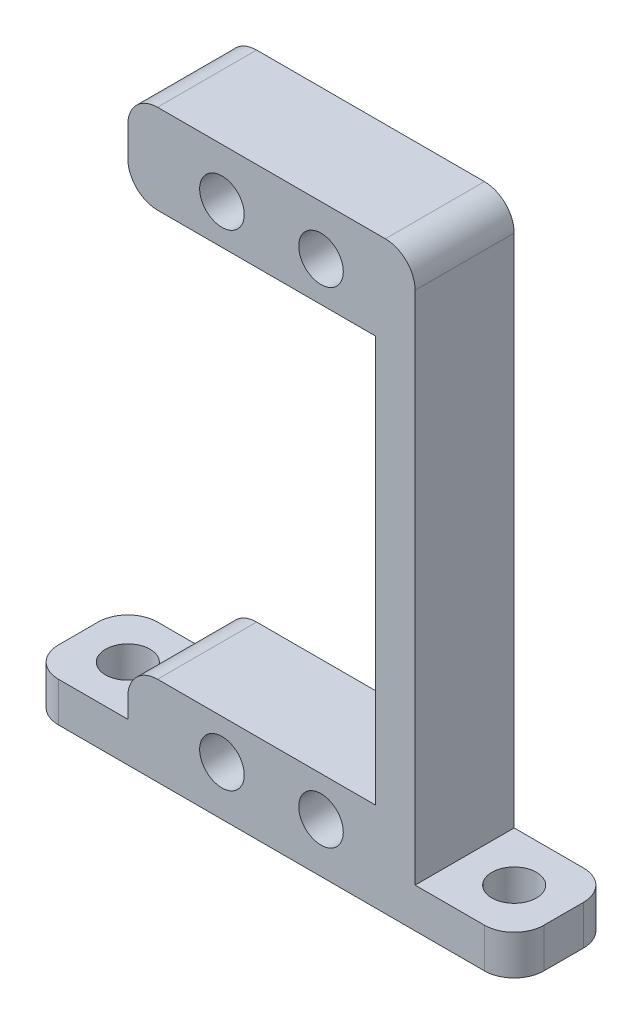
ISO-10303-21;
HEADER;
FILE_DESCRIPTION(('STEP AP214'),'2;1');
FILE_NAME('part.step','',(''),(''),'','','');
FILE_SCHEMA(('AUTOMOTIVE_DESIGN { 1 0 10303 214 1 1 1 1 }'));
ENDSEC;
DATA;
#1=APPLICATION_CONTEXT('core data for automotive mechanical design processes');
#2=APPLICATION_PROTOCOL_DEFINITION('international standard','automotive_design',2000,#1);
#3=PRODUCT_CONTEXT('',#1,'mechanical');
#4=PRODUCT('Part','Part','',(#3));
#5=PRODUCT_RELATED_PRODUCT_CATEGORY('part','',(#4));
#6=PRODUCT_DEFINITION_FORMATION('','',#4);
#7=PRODUCT_DEFINITION_CONTEXT('part definition',#1,'design');
#8=PRODUCT_DEFINITION('design','',#6,#7);
#9=PRODUCT_DEFINITION_SHAPE('','',#8);
#10=(LENGTH_UNIT() NAMED_UNIT(*) SI_UNIT(.MILLI.,.METRE.));
#11=(NAMED_UNIT(*) PLANE_ANGLE_UNIT() SI_UNIT($,.RADIAN.));
#12=(NAMED_UNIT(*) SI_UNIT($,.STERADIAN.) SOLID_ANGLE_UNIT());
#13=UNCERTAINTY_MEASURE_WITH_UNIT(LENGTH_MEASURE(1.E-05),#10,'distance_accuracy_value','');
#14=(GEOMETRIC_REPRESENTATION_CONTEXT(3) GLOBAL_UNCERTAINTY_ASSIGNED_CONTEXT((#13)) GLOBAL_UNIT_ASSIGNED_CONTEXT((#10,
#11,#12)) REPRESENTATION_CONTEXT('',''));
#15=CARTESIAN_POINT('',(0.,0.,0.));
#16=DIRECTION('',(0.,0.,1.));
#17=DIRECTION('',(1.,0.,0.));
#18=AXIS2_PLACEMENT_3D('',#15,#16,#17);
#19=CARTESIAN_POINT('',(0.,-25.5,10.));
#20=DIRECTION('',(0.,1.,0.));
#21=DIRECTION('',(0.,0.,1.));
#22=AXIS2_PLACEMENT_3D('',#19,#20,#21);
#23=PLANE('',#22);
#24=CARTESIAN_POINT('',(-19.5,-25.5,5.));
#25=DIRECTION('',(0.,1.,0.));
#26=DIRECTION('',(0.,0.,-1.));
#27=AXIS2_PLACEMENT_3D('',#24,#25,#26);
#28=CIRCLE('',#27,2.25);
#29=CARTESIAN_POINT('',(-19.5,-25.5,2.75));
#30=VERTEX_POINT('',#29);
#31=EDGE_CURVE('E501',#30,#30,#28,.T.);
#32=ORIENTED_EDGE('',*,*,#31,.F.);
#33=EDGE_LOOP('',(#32));
#34=FACE_BOUND('',#33,.T.);
#35=DIRECTION('',(1.,0.,0.));
#36=VECTOR('',#35,1.);
#37=CARTESIAN_POINT('',(0.,-25.5,0.));
#38=LINE('',#37,#36);
#39=CARTESIAN_POINT('',(-21.5,-25.5,0.));
#40=VERTEX_POINT('',#39);
#41=CARTESIAN_POINT('',(-14.5,-25.5,0.));
#42=VERTEX_POINT('',#41);
#43=EDGE_CURVE('E219',#40,#42,#38,.T.);
#44=ORIENTED_EDGE('',*,*,#43,.F.);
#45=CARTESIAN_POINT('',(-21.5,-25.5,3.));
#46=DIRECTION('',(0.,1.,0.));
#47=DIRECTION('',(0.,0.,1.));
#48=AXIS2_PLACEMENT_3D('',#45,#46,#47);
#49=CIRCLE('',#48,3.);
#50=CARTESIAN_POINT('',(-24.5,-25.5,3.));
#51=VERTEX_POINT('',#50);
#52=EDGE_CURVE('E265',#40,#51,#49,.T.);
#53=ORIENTED_EDGE('',*,*,#52,.T.);
#54=DIRECTION('',(0.,0.,-1.));
#55=VECTOR('',#54,1.);
#56=CARTESIAN_POINT('',(-24.5,-25.5,10.));
#57=LINE('',#56,#55);
#58=CARTESIAN_POINT('',(-24.5,-25.5,7.));
#59=VERTEX_POINT('',#58);
#60=EDGE_CURVE('E212',#59,#51,#57,.T.);
#61=ORIENTED_EDGE('',*,*,#60,.F.);
#62=CARTESIAN_POINT('',(-21.5,-25.5,7.));
#63=DIRECTION('',(0.,1.,0.));
#64=DIRECTION('',(0.,0.,1.));
#65=AXIS2_PLACEMENT_3D('',#62,#63,#64);
#66=CIRCLE('',#65,3.);
#67=CARTESIAN_POINT('',(-21.5,-25.5,10.));
#68=VERTEX_POINT('',#67);
#69=EDGE_CURVE('E263',#59,#68,#66,.T.);
#70=ORIENTED_EDGE('',*,*,#69,.T.);
#71=DIRECTION('',(1.,0.,0.));
#72=VECTOR('',#71,1.);
#73=CARTESIAN_POINT('',(0.,-25.5,10.));
#74=LINE('',#73,#72);
#75=CARTESIAN_POINT('',(-14.5,-25.5,10.));
#76=VERTEX_POINT('',#75);
#77=EDGE_CURVE('E336',#68,#76,#74,.T.);
#78=ORIENTED_EDGE('',*,*,#77,.T.);
#79=DIRECTION('',(0.,0.,-1.));
#80=VECTOR('',#79,1.);
#81=CARTESIAN_POINT('',(-14.5,-25.5,10.));
#82=LINE('',#81,#80);
#83=EDGE_CURVE('E337',#76,#42,#82,.T.);
#84=ORIENTED_EDGE('',*,*,#83,.T.);
#85=EDGE_LOOP('',(#44,#53,#61,#70,#78,#84));
#86=FACE_BOUND('',#85,.T.);
#87=ADVANCED_FACE('F36',(#34,#86),#23,.T.);
#88=CARTESIAN_POINT('',(-24.5,0.,10.));
#89=DIRECTION('',(-1.,0.,0.));
#90=DIRECTION('',(0.,0.,1.));
#91=AXIS2_PLACEMENT_3D('',#88,#89,#90);
#92=PLANE('',#91);
#93=ORIENTED_EDGE('',*,*,#60,.T.);
#94=DIRECTION('',(0.,1.,0.));
#95=VECTOR('',#94,1.);
#96=CARTESIAN_POINT('',(-24.5,-29.5,3.));
#97=LINE('',#96,#95);
#98=CARTESIAN_POINT('',(-24.5,-29.5,3.));
#99=VERTEX_POINT('',#98);
#100=EDGE_CURVE('E270',#51,#99,#97,.F.);
#101=ORIENTED_EDGE('',*,*,#100,.T.);
#102=DIRECTION('',(0.,0.,-1.));
#103=VECTOR('',#102,1.);
#104=CARTESIAN_POINT('',(-24.5,-29.5,10.));
#105=LINE('',#104,#103);
#106=CARTESIAN_POINT('',(-24.5,-29.5,7.));
#107=VERTEX_POINT('',#106);
#108=EDGE_CURVE('E209',#107,#99,#105,.T.);
#109=ORIENTED_EDGE('',*,*,#108,.F.);
#110=DIRECTION('',(0.,1.,0.));
#111=VECTOR('',#110,1.);
#112=CARTESIAN_POINT('',(-24.5,0.,7.));
#113=LINE('',#112,#111);
#114=EDGE_CURVE('E267',#107,#59,#113,.T.);
#115=ORIENTED_EDGE('',*,*,#114,.T.);
#116=EDGE_LOOP('',(#93,#101,#109,#115));
#117=FACE_BOUND('',#116,.T.);
#118=ADVANCED_FACE('F401',(#117),#92,.T.);
#119=CARTESIAN_POINT('',(0.,-29.5,10.));
#120=DIRECTION('',(0.,-1.,0.));
#121=DIRECTION('',(1.,0.,0.));
#122=AXIS2_PLACEMENT_3D('',#119,#120,#121);
#123=PLANE('',#122);
#124=CARTESIAN_POINT('',(19.5,-29.5,5.));
#125=DIRECTION('',(0.,-1.,0.));
#126=DIRECTION('',(1.,0.,0.));
#127=AXIS2_PLACEMENT_3D('',#124,#125,#126);
#128=CIRCLE('',#127,2.25);
#129=CARTESIAN_POINT('',(21.75,-29.5,5.));
#130=VERTEX_POINT('',#129);
#131=EDGE_CURVE('E220',#130,#130,#128,.T.);
#132=ORIENTED_EDGE('',*,*,#131,.F.);
#133=EDGE_LOOP('',(#132));
#134=FACE_BOUND('',#133,.T.);
#135=CARTESIAN_POINT('',(-19.5,-29.5,5.));
#136=DIRECTION('',(0.,-1.,0.));
#137=DIRECTION('',(1.,0.,0.));
#138=AXIS2_PLACEMENT_3D('',#135,#136,#137);
#139=CIRCLE('',#138,2.25);
#140=CARTESIAN_POINT('',(-17.25,-29.5,5.));
#141=VERTEX_POINT('',#140);
#142=EDGE_CURVE('E216',#141,#141,#139,.T.);
#143=ORIENTED_EDGE('',*,*,#142,.F.);
#144=EDGE_LOOP('',(#143));
#145=FACE_BOUND('',#144,.T.);
#146=ORIENTED_EDGE('',*,*,#108,.T.);
#147=CARTESIAN_POINT('',(-21.5,-29.5,3.));
#148=DIRECTION('',(0.,-1.,0.));
#149=DIRECTION('',(1.,0.,0.));
#150=AXIS2_PLACEMENT_3D('',#147,#148,#149);
#151=CIRCLE('',#150,3.);
#152=CARTESIAN_POINT('',(-21.5,-29.5,0.));
#153=VERTEX_POINT('',#152);
#154=EDGE_CURVE('E278',#99,#153,#151,.T.);
#155=ORIENTED_EDGE('',*,*,#154,.T.);
#156=DIRECTION('',(-1.,0.,0.));
#157=VECTOR('',#156,1.);
#158=CARTESIAN_POINT('',(0.,-29.5,0.));
#159=LINE('',#158,#157);
#160=CARTESIAN_POINT('',(21.5,-29.5,0.));
#161=VERTEX_POINT('',#160);
#162=EDGE_CURVE('E295',#161,#153,#159,.T.);
#163=ORIENTED_EDGE('',*,*,#162,.F.);
#164=CARTESIAN_POINT('',(21.5,-29.5,3.));
#165=DIRECTION('',(0.,-1.,0.));
#166=DIRECTION('',(1.,0.,0.));
#167=AXIS2_PLACEMENT_3D('',#164,#165,#166);
#168=CIRCLE('',#167,3.);
#169=CARTESIAN_POINT('',(24.5,-29.5,3.));
#170=VERTEX_POINT('',#169);
#171=EDGE_CURVE('E274',#161,#170,#168,.T.);
#172=ORIENTED_EDGE('',*,*,#171,.T.);
#173=DIRECTION('',(0.,0.,-1.));
#174=VECTOR('',#173,1.);
#175=CARTESIAN_POINT('',(24.5,-29.5,10.));
#176=LINE('',#175,#174);
#177=CARTESIAN_POINT('',(24.5,-29.5,7.));
#178=VERTEX_POINT('',#177);
#179=EDGE_CURVE('E201',#178,#170,#176,.T.);
#180=ORIENTED_EDGE('',*,*,#179,.F.);
#181=CARTESIAN_POINT('',(21.5,-29.5,7.));
#182=DIRECTION('',(0.,-1.,0.));
#183=DIRECTION('',(1.,0.,0.));
#184=AXIS2_PLACEMENT_3D('',#181,#182,#183);
#185=CIRCLE('',#184,3.);
#186=CARTESIAN_POINT('',(21.5,-29.5,10.));
#187=VERTEX_POINT('',#186);
#188=EDGE_CURVE('E272',#178,#187,#185,.T.);
#189=ORIENTED_EDGE('',*,*,#188,.T.);
#190=DIRECTION('',(-1.,0.,0.));
#191=VECTOR('',#190,1.);
#192=CARTESIAN_POINT('',(0.,-29.5,10.));
#193=LINE('',#192,#191);
#194=CARTESIAN_POINT('',(-21.5,-29.5,10.));
#195=VERTEX_POINT('',#194);
#196=EDGE_CURVE('E192',#187,#195,#193,.T.);
#197=ORIENTED_EDGE('',*,*,#196,.T.);
#198=CARTESIAN_POINT('',(-21.5,-29.5,7.));
#199=DIRECTION('',(0.,-1.,0.));
#200=DIRECTION('',(1.,0.,0.));
#201=AXIS2_PLACEMENT_3D('',#198,#199,#200);
#202=CIRCLE('',#201,3.);
#203=EDGE_CURVE('E276',#195,#107,#202,.T.);
#204=ORIENTED_EDGE('',*,*,#203,.T.);
#205=EDGE_LOOP('',(#146,#155,#163,#172,#180,#189,#197,#204));
#206=FACE_BOUND('',#205,.T.);
#207=ADVANCED_FACE('F299',(#134,#145,#206),#123,.T.);
#208=CARTESIAN_POINT('',(24.5,0.,10.));
#209=DIRECTION('',(-1.,0.,0.));
#210=DIRECTION('',(0.,0.,1.));
#211=AXIS2_PLACEMENT_3D('',#208,#209,#210);
#212=PLANE('',#211);
#213=ORIENTED_EDGE('',*,*,#179,.T.);
#214=DIRECTION('',(0.,1.,0.));
#215=VECTOR('',#214,1.);
#216=CARTESIAN_POINT('',(24.5,0.,3.));
#217=LINE('',#216,#215);
#218=CARTESIAN_POINT('',(24.5,-25.5,3.));
#219=VERTEX_POINT('',#218);
#220=EDGE_CURVE('E282',#170,#219,#217,.T.);
#221=ORIENTED_EDGE('',*,*,#220,.T.);
#222=DIRECTION('',(0.,0.,-1.));
#223=VECTOR('',#222,1.);
#224=CARTESIAN_POINT('',(24.5,-25.5,10.));
#225=LINE('',#224,#223);
#226=CARTESIAN_POINT('',(24.5,-25.5,7.));
#227=VERTEX_POINT('',#226);
#228=EDGE_CURVE('E198',#227,#219,#225,.T.);
#229=ORIENTED_EDGE('',*,*,#228,.F.);
#230=DIRECTION('',(0.,1.,0.));
#231=VECTOR('',#230,1.);
#232=CARTESIAN_POINT('',(24.5,-29.5,7.));
#233=LINE('',#232,#231);
#234=EDGE_CURVE('E280',#227,#178,#233,.F.);
#235=ORIENTED_EDGE('',*,*,#234,.T.);
#236=EDGE_LOOP('',(#213,#221,#229,#235));
#237=FACE_BOUND('',#236,.T.);
#238=ADVANCED_FACE('F284',(#237),#212,.F.);
#239=CARTESIAN_POINT('',(0.,-25.5,10.));
#240=DIRECTION('',(0.,-1.,0.));
#241=DIRECTION('',(0.,0.,-1.));
#242=AXIS2_PLACEMENT_3D('',#239,#240,#241);
#243=PLANE('',#242);
#244=CARTESIAN_POINT('',(19.5,-25.5,5.));
#245=DIRECTION('',(0.,1.,0.));
#246=DIRECTION('',(0.,0.,1.));
#247=AXIS2_PLACEMENT_3D('',#244,#245,#246);
#248=CIRCLE('',#247,2.25);
#249=CARTESIAN_POINT('',(19.5,-25.5,7.25));
#250=VERTEX_POINT('',#249);
#251=EDGE_CURVE('E502',#250,#250,#248,.T.);
#252=ORIENTED_EDGE('',*,*,#251,.F.);
#253=EDGE_LOOP('',(#252));
#254=FACE_BOUND('',#253,.T.);
#255=ORIENTED_EDGE('',*,*,#228,.T.);
#256=CARTESIAN_POINT('',(21.5,-25.5,3.));
#257=DIRECTION('',(0.,-1.,0.));
#258=DIRECTION('',(0.,0.,-1.));
#259=AXIS2_PLACEMENT_3D('',#256,#257,#258);
#260=CIRCLE('',#259,3.);
#261=CARTESIAN_POINT('',(21.5,-25.5,0.));
#262=VERTEX_POINT('',#261);
#263=EDGE_CURVE('E11',#219,#262,#260,.F.);
#264=ORIENTED_EDGE('',*,*,#263,.T.);
#265=DIRECTION('',(-1.,0.,0.));
#266=VECTOR('',#265,1.);
#267=CARTESIAN_POINT('',(0.,-25.5,0.));
#268=LINE('',#267,#266);
#269=CARTESIAN_POINT('',(14.5,-25.5,0.));
#270=VERTEX_POINT('',#269);
#271=EDGE_CURVE('E196',#262,#270,#268,.T.);
#272=ORIENTED_EDGE('',*,*,#271,.T.);
#273=DIRECTION('',(0.,0.,-1.));
#274=VECTOR('',#273,1.);
#275=CARTESIAN_POINT('',(14.5,-25.5,10.));
#276=LINE('',#275,#274);
#277=CARTESIAN_POINT('',(14.5,-25.5,10.));
#278=VERTEX_POINT('',#277);
#279=EDGE_CURVE('E177',#278,#270,#276,.T.);
#280=ORIENTED_EDGE('',*,*,#279,.F.);
#281=DIRECTION('',(-1.,0.,0.));
#282=VECTOR('',#281,1.);
#283=CARTESIAN_POINT('',(0.,-25.5,10.));
#284=LINE('',#283,#282);
#285=CARTESIAN_POINT('',(21.5,-25.5,10.));
#286=VERTEX_POINT('',#285);
#287=EDGE_CURVE('E183',#286,#278,#284,.T.);
#288=ORIENTED_EDGE('',*,*,#287,.F.);
#289=CARTESIAN_POINT('',(21.5,-25.5,7.));
#290=DIRECTION('',(0.,-1.,0.));
#291=DIRECTION('',(0.,0.,-1.));
#292=AXIS2_PLACEMENT_3D('',#289,#290,#291);
#293=CIRCLE('',#292,3.);
#294=EDGE_CURVE('E44',#286,#227,#293,.F.);
#295=ORIENTED_EDGE('',*,*,#294,.T.);
#296=EDGE_LOOP('',(#255,#264,#272,#280,#288,#295));
#297=FACE_BOUND('',#296,.T.);
#298=ADVANCED_FACE('F194',(#254,#297),#243,.F.);
#299=CARTESIAN_POINT('',(14.5,0.,10.));
#300=DIRECTION('',(1.,0.,0.));
#301=DIRECTION('',(0.,1.,0.));
#302=AXIS2_PLACEMENT_3D('',#299,#300,#301);
#303=PLANE('',#302);
#304=DIRECTION('',(0.,-1.,0.));
#305=VECTOR('',#304,1.);
#306=CARTESIAN_POINT('',(14.5,0.,0.));
#307=LINE('',#306,#305);
#308=CARTESIAN_POINT('',(14.5,26.5,0.));
#309=VERTEX_POINT('',#308);
#310=EDGE_CURVE('E294',#309,#270,#307,.T.);
#311=ORIENTED_EDGE('',*,*,#310,.F.);
#312=DIRECTION('',(0.,0.,-1.));
#313=VECTOR('',#312,1.);
#314=CARTESIAN_POINT('',(14.5,26.5,10.));
#315=LINE('',#314,#313);
#316=CARTESIAN_POINT('',(14.5,26.5,10.));
#317=VERTEX_POINT('',#316);
#318=EDGE_CURVE('E179',#309,#317,#315,.F.);
#319=ORIENTED_EDGE('',*,*,#318,.T.);
#320=DIRECTION('',(0.,-1.,0.));
#321=VECTOR('',#320,1.);
#322=CARTESIAN_POINT('',(14.5,0.,10.));
#323=LINE('',#322,#321);
#324=EDGE_CURVE('E172',#317,#278,#323,.T.);
#325=ORIENTED_EDGE('',*,*,#324,.T.);
#326=ORIENTED_EDGE('',*,*,#279,.T.);
#327=EDGE_LOOP('',(#311,#319,#325,#326));
#328=FACE_BOUND('',#327,.T.);
#329=ADVANCED_FACE('F175',(#328),#303,.T.);
#330=CARTESIAN_POINT('',(0.,29.5,10.));
#331=DIRECTION('',(0.,1.,0.));
#332=DIRECTION('',(0.,0.,1.));
#333=AXIS2_PLACEMENT_3D('',#330,#331,#332);
#334=PLANE('',#333);
#335=DIRECTION('',(1.,0.,0.));
#336=VECTOR('',#335,1.);
#337=CARTESIAN_POINT('',(0.,29.5,10.));
#338=LINE('',#337,#336);
#339=CARTESIAN_POINT('',(-11.5,29.5,10.));
#340=VERTEX_POINT('',#339);
#341=CARTESIAN_POINT('',(11.5,29.5,10.));
#342=VERTEX_POINT('',#341);
#343=EDGE_CURVE('E182',#340,#342,#338,.T.);
#344=ORIENTED_EDGE('',*,*,#343,.T.);
#345=DIRECTION('',(0.,0.,-1.));
#346=VECTOR('',#345,1.);
#347=CARTESIAN_POINT('',(11.5,29.5,10.));
#348=LINE('',#347,#346);
#349=CARTESIAN_POINT('',(11.5,29.5,0.));
#350=VERTEX_POINT('',#349);
#351=EDGE_CURVE('E251',#342,#350,#348,.T.);
#352=ORIENTED_EDGE('',*,*,#351,.T.);
#353=DIRECTION('',(1.,0.,0.));
#354=VECTOR('',#353,1.);
#355=CARTESIAN_POINT('',(0.,29.5,0.));
#356=LINE('',#355,#354);
#357=CARTESIAN_POINT('',(-11.5,29.5,0.));
#358=VERTEX_POINT('',#357);
#359=EDGE_CURVE('E308',#358,#350,#356,.T.);
#360=ORIENTED_EDGE('',*,*,#359,.F.);
#361=DIRECTION('',(0.,0.,-1.));
#362=VECTOR('',#361,1.);
#363=CARTESIAN_POINT('',(-11.5,29.5,10.));
#364=LINE('',#363,#362);
#365=EDGE_CURVE('E249',#358,#340,#364,.F.);
#366=ORIENTED_EDGE('',*,*,#365,.T.);
#367=EDGE_LOOP('',(#344,#352,#360,#366));
#368=FACE_BOUND('',#367,.T.);
#369=ADVANCED_FACE('F471',(#368),#334,.T.);
#370=CARTESIAN_POINT('',(-14.5,0.,10.));
#371=DIRECTION('',(-1.,0.,0.));
#372=DIRECTION('',(0.,-1.,0.));
#373=AXIS2_PLACEMENT_3D('',#370,#371,#372);
#374=PLANE('',#373);
#375=DIRECTION('',(0.,1.,0.));
#376=VECTOR('',#375,1.);
#377=CARTESIAN_POINT('',(-14.5,0.,0.));
#378=LINE('',#377,#376);
#379=CARTESIAN_POINT('',(-14.5,23.5,0.));
#380=VERTEX_POINT('',#379);
#381=CARTESIAN_POINT('',(-14.5,26.5,0.));
#382=VERTEX_POINT('',#381);
#383=EDGE_CURVE('E311',#380,#382,#378,.T.);
#384=ORIENTED_EDGE('',*,*,#383,.F.);
#385=DIRECTION('',(0.,0.,-1.));
#386=VECTOR('',#385,1.);
#387=CARTESIAN_POINT('',(-14.5,23.5,10.));
#388=LINE('',#387,#386);
#389=CARTESIAN_POINT('',(-14.5,23.5,10.));
#390=VERTEX_POINT('',#389);
#391=EDGE_CURVE('E261',#380,#390,#388,.F.);
#392=ORIENTED_EDGE('',*,*,#391,.T.);
#393=DIRECTION('',(0.,1.,0.));
#394=VECTOR('',#393,1.);
#395=CARTESIAN_POINT('',(-14.5,0.,10.));
#396=LINE('',#395,#394);
#397=CARTESIAN_POINT('',(-14.5,26.5,10.));
#398=VERTEX_POINT('',#397);
#399=EDGE_CURVE('E451',#390,#398,#396,.T.);
#400=ORIENTED_EDGE('',*,*,#399,.T.);
#401=DIRECTION('',(0.,0.,-1.));
#402=VECTOR('',#401,1.);
#403=CARTESIAN_POINT('',(-14.5,26.5,10.));
#404=LINE('',#403,#402);
#405=EDGE_CURVE('E258',#398,#382,#404,.T.);
#406=ORIENTED_EDGE('',*,*,#405,.T.);
#407=EDGE_LOOP('',(#384,#392,#400,#406));
#408=FACE_BOUND('',#407,.T.);
#409=ADVANCED_FACE('F465',(#408),#374,.T.);
#410=CARTESIAN_POINT('',(0.,20.5,10.));
#411=DIRECTION('',(0.,-1.,0.));
#412=DIRECTION('',(0.,0.,-1.));
#413=AXIS2_PLACEMENT_3D('',#410,#411,#412);
#414=PLANE('',#413);
#415=DIRECTION('',(-1.,0.,0.));
#416=VECTOR('',#415,1.);
#417=CARTESIAN_POINT('',(0.,20.5,10.));
#418=LINE('',#417,#416);
#419=CARTESIAN_POINT('',(10.5,20.5,10.));
#420=VERTEX_POINT('',#419);
#421=CARTESIAN_POINT('',(-11.5,20.5,10.));
#422=VERTEX_POINT('',#421);
#423=EDGE_CURVE('E454',#420,#422,#418,.T.);
#424=ORIENTED_EDGE('',*,*,#423,.T.);
#425=DIRECTION('',(0.,0.,-1.));
#426=VECTOR('',#425,1.);
#427=CARTESIAN_POINT('',(-11.5,20.5,10.));
#428=LINE('',#427,#426);
#429=CARTESIAN_POINT('',(-11.5,20.5,0.));
#430=VERTEX_POINT('',#429);
#431=EDGE_CURVE('E255',#422,#430,#428,.T.);
#432=ORIENTED_EDGE('',*,*,#431,.T.);
#433=DIRECTION('',(-1.,0.,0.));
#434=VECTOR('',#433,1.);
#435=CARTESIAN_POINT('',(0.,20.5,0.));
#436=LINE('',#435,#434);
#437=CARTESIAN_POINT('',(10.5,20.5,0.));
#438=VERTEX_POINT('',#437);
#439=EDGE_CURVE('E314',#438,#430,#436,.T.);
#440=ORIENTED_EDGE('',*,*,#439,.F.);
#441=DIRECTION('',(0.,0.,-1.));
#442=VECTOR('',#441,1.);
#443=CARTESIAN_POINT('',(10.5,20.5,10.));
#444=LINE('',#443,#442);
#445=EDGE_CURVE('E199',#420,#438,#444,.T.);
#446=ORIENTED_EDGE('',*,*,#445,.F.);
#447=EDGE_LOOP('',(#424,#432,#440,#446));
#448=FACE_BOUND('',#447,.T.);
#449=ADVANCED_FACE('F461',(#448),#414,.T.);
#450=CARTESIAN_POINT('',(10.5,0.,10.));
#451=DIRECTION('',(-1.,0.,0.));
#452=DIRECTION('',(0.,0.,1.));
#453=AXIS2_PLACEMENT_3D('',#450,#451,#452);
#454=PLANE('',#453);
#455=DIRECTION('',(0.,1.,0.));
#456=VECTOR('',#455,1.);
#457=CARTESIAN_POINT('',(10.5,0.,0.));
#458=LINE('',#457,#456);
#459=CARTESIAN_POINT('',(10.5,-20.5,0.));
#460=VERTEX_POINT('',#459);
#461=EDGE_CURVE('E317',#460,#438,#458,.T.);
#462=ORIENTED_EDGE('',*,*,#461,.F.);
#463=DIRECTION('',(0.,0.,-1.));
#464=VECTOR('',#463,1.);
#465=CARTESIAN_POINT('',(10.5,-20.5,10.));
#466=LINE('',#465,#464);
#467=CARTESIAN_POINT('',(10.5,-20.5,10.));
#468=VERTEX_POINT('',#467);
#469=EDGE_CURVE('E203',#468,#460,#466,.T.);
#470=ORIENTED_EDGE('',*,*,#469,.F.);
#471=DIRECTION('',(0.,1.,0.));
#472=VECTOR('',#471,1.);
#473=CARTESIAN_POINT('',(10.5,0.,10.));
#474=LINE('',#473,#472);
#475=EDGE_CURVE('E370',#468,#420,#474,.T.);
#476=ORIENTED_EDGE('',*,*,#475,.T.);
#477=ORIENTED_EDGE('',*,*,#445,.T.);
#478=EDGE_LOOP('',(#462,#470,#476,#477));
#479=FACE_BOUND('',#478,.T.);
#480=ADVANCED_FACE('F351',(#479),#454,.T.);
#481=CARTESIAN_POINT('',(0.,-20.5,10.));
#482=DIRECTION('',(0.,1.,0.));
#483=DIRECTION('',(0.,0.,1.));
#484=AXIS2_PLACEMENT_3D('',#481,#482,#483);
#485=PLANE('',#484);
#486=DIRECTION('',(1.,0.,0.));
#487=VECTOR('',#486,1.);
#488=CARTESIAN_POINT('',(0.,-20.5,0.));
#489=LINE('',#488,#487);
#490=CARTESIAN_POINT('',(-11.5,-20.5,0.));
#491=VERTEX_POINT('',#490);
#492=EDGE_CURVE('E320',#491,#460,#489,.T.);
#493=ORIENTED_EDGE('',*,*,#492,.F.);
#494=DIRECTION('',(0.,0.,-1.));
#495=VECTOR('',#494,1.);
#496=CARTESIAN_POINT('',(-11.5,-20.5,10.));
#497=LINE('',#496,#495);
#498=CARTESIAN_POINT('',(-11.5,-20.5,10.));
#499=VERTEX_POINT('',#498);
#500=EDGE_CURVE('E236',#491,#499,#497,.F.);
#501=ORIENTED_EDGE('',*,*,#500,.T.);
#502=DIRECTION('',(1.,0.,0.));
#503=VECTOR('',#502,1.);
#504=CARTESIAN_POINT('',(0.,-20.5,10.));
#505=LINE('',#504,#503);
#506=EDGE_CURVE('E347',#499,#468,#505,.T.);
#507=ORIENTED_EDGE('',*,*,#506,.T.);
#508=ORIENTED_EDGE('',*,*,#469,.T.);
#509=EDGE_LOOP('',(#493,#501,#507,#508));
#510=FACE_BOUND('',#509,.T.);
#511=ADVANCED_FACE('F345',(#510),#485,.T.);
#512=CARTESIAN_POINT('',(4.99999999999999,-24.5,10.));
#513=DIRECTION('',(0.,0.,-1.));
#514=DIRECTION('',(-1.,0.,0.));
#515=AXIS2_PLACEMENT_3D('',#512,#513,#514);
#516=CYLINDRICAL_SURFACE('',#515,2.25);
#517=CARTESIAN_POINT('',(4.99999999999999,-24.5,10.));
#518=DIRECTION('',(0.,0.,1.));
#519=DIRECTION('',(1.,0.,0.));
#520=AXIS2_PLACEMENT_3D('',#517,#518,#519);
#521=CIRCLE('',#520,2.25);
#522=CARTESIAN_POINT('',(7.25,-24.5,10.));
#523=VERTEX_POINT('',#522);
#524=EDGE_CURVE('E376',#523,#523,#521,.T.);
#525=ORIENTED_EDGE('',*,*,#524,.T.);
#526=EDGE_LOOP('',(#525));
#527=FACE_BOUND('',#526,.T.);
#528=CARTESIAN_POINT('',(4.99999999999999,-24.5,0.));
#529=DIRECTION('',(0.,0.,1.));
#530=DIRECTION('',(1.,0.,0.));
#531=AXIS2_PLACEMENT_3D('',#528,#529,#530);
#532=CIRCLE('',#531,2.25);
#533=CARTESIAN_POINT('',(7.25,-24.5,0.));
#534=VERTEX_POINT('',#533);
#535=EDGE_CURVE('E330',#534,#534,#532,.T.);
#536=ORIENTED_EDGE('',*,*,#535,.F.);
#537=EDGE_LOOP('',(#536));
#538=FACE_BOUND('',#537,.T.);
#539=ADVANCED_FACE('F603',(#527,#538),#516,.F.);
#540=CARTESIAN_POINT('',(-5.00000000000001,24.5,10.));
#541=DIRECTION('',(0.,0.,-1.));
#542=DIRECTION('',(-1.,0.,0.));
#543=AXIS2_PLACEMENT_3D('',#540,#541,#542);
#544=CYLINDRICAL_SURFACE('',#543,2.25);
#545=CARTESIAN_POINT('',(-5.00000000000001,24.5,10.));
#546=DIRECTION('',(0.,0.,1.));
#547=DIRECTION('',(1.,0.,0.));
#548=AXIS2_PLACEMENT_3D('',#545,#546,#547);
#549=CIRCLE('',#548,2.25);
#550=CARTESIAN_POINT('',(-2.75,24.5,10.));
#551=VERTEX_POINT('',#550);
#552=EDGE_CURVE('E368',#551,#551,#549,.T.);
#553=ORIENTED_EDGE('',*,*,#552,.T.);
#554=EDGE_LOOP('',(#553));
#555=FACE_BOUND('',#554,.T.);
#556=CARTESIAN_POINT('',(-5.00000000000001,24.5,0.));
#557=DIRECTION('',(0.,0.,1.));
#558=DIRECTION('',(1.,0.,0.));
#559=AXIS2_PLACEMENT_3D('',#556,#557,#558);
#560=CIRCLE('',#559,2.25);
#561=CARTESIAN_POINT('',(-2.75,24.5,0.));
#562=VERTEX_POINT('',#561);
#563=EDGE_CURVE('E327',#562,#562,#560,.T.);
#564=ORIENTED_EDGE('',*,*,#563,.F.);
#565=EDGE_LOOP('',(#564));
#566=FACE_BOUND('',#565,.T.);
#567=ADVANCED_FACE('F596',(#555,#566),#544,.F.);
#568=CARTESIAN_POINT('',(4.99999999999999,24.5,10.));
#569=DIRECTION('',(0.,0.,-1.));
#570=DIRECTION('',(-1.,0.,0.));
#571=AXIS2_PLACEMENT_3D('',#568,#569,#570);
#572=CYLINDRICAL_SURFACE('',#571,2.25);
#573=CARTESIAN_POINT('',(4.99999999999999,24.5,10.));
#574=DIRECTION('',(0.,0.,1.));
#575=DIRECTION('',(1.,0.,0.));
#576=AXIS2_PLACEMENT_3D('',#573,#574,#575);
#577=CIRCLE('',#576,2.25);
#578=CARTESIAN_POINT('',(7.25,24.5,10.));
#579=VERTEX_POINT('',#578);
#580=EDGE_CURVE('E365',#579,#579,#577,.F.);
#581=ORIENTED_EDGE('',*,*,#580,.F.);
#582=EDGE_LOOP('',(#581));
#583=FACE_BOUND('',#582,.T.);
#584=CARTESIAN_POINT('',(4.99999999999999,24.5,0.));
#585=DIRECTION('',(0.,0.,1.));
#586=DIRECTION('',(1.,0.,0.));
#587=AXIS2_PLACEMENT_3D('',#584,#585,#586);
#588=CIRCLE('',#587,2.25);
#589=CARTESIAN_POINT('',(7.25,24.5,0.));
#590=VERTEX_POINT('',#589);
#591=EDGE_CURVE('E324',#590,#590,#588,.F.);
#592=ORIENTED_EDGE('',*,*,#591,.T.);
#593=EDGE_LOOP('',(#592));
#594=FACE_BOUND('',#593,.T.);
#595=ADVANCED_FACE('F587',(#583,#594),#572,.F.);
#596=CARTESIAN_POINT('',(-14.5,0.,10.));
#597=DIRECTION('',(-1.,0.,0.));
#598=DIRECTION('',(0.,0.,1.));
#599=AXIS2_PLACEMENT_3D('',#596,#597,#598);
#600=PLANE('',#599);
#601=DIRECTION('',(0.,1.,0.));
#602=VECTOR('',#601,1.);
#603=CARTESIAN_POINT('',(-14.5,0.,10.));
#604=LINE('',#603,#602);
#605=CARTESIAN_POINT('',(-14.5,-23.5,10.));
#606=VERTEX_POINT('',#605);
#607=EDGE_CURVE('E363',#76,#606,#604,.T.);
#608=ORIENTED_EDGE('',*,*,#607,.T.);
#609=DIRECTION('',(0.,0.,-1.));
#610=VECTOR('',#609,1.);
#611=CARTESIAN_POINT('',(-14.5,-23.5,10.));
#612=LINE('',#611,#610);
#613=CARTESIAN_POINT('',(-14.5,-23.5,0.));
#614=VERTEX_POINT('',#613);
#615=EDGE_CURVE('E215',#606,#614,#612,.T.);
#616=ORIENTED_EDGE('',*,*,#615,.T.);
#617=DIRECTION('',(0.,1.,0.));
#618=VECTOR('',#617,1.);
#619=CARTESIAN_POINT('',(-14.5,0.,0.));
#620=LINE('',#619,#618);
#621=EDGE_CURVE('E322',#42,#614,#620,.T.);
#622=ORIENTED_EDGE('',*,*,#621,.F.);
#623=ORIENTED_EDGE('',*,*,#83,.F.);
#624=EDGE_LOOP('',(#608,#616,#622,#623));
#625=FACE_BOUND('',#624,.T.);
#626=ADVANCED_FACE('F360',(#625),#600,.T.);
#627=CARTESIAN_POINT('',(-5.00000000000001,-24.5,10.));
#628=DIRECTION('',(0.,0.,-1.));
#629=DIRECTION('',(-1.,0.,0.));
#630=AXIS2_PLACEMENT_3D('',#627,#628,#629);
#631=CYLINDRICAL_SURFACE('',#630,2.25);
#632=CARTESIAN_POINT('',(-5.00000000000001,-24.5,10.));
#633=DIRECTION('',(0.,0.,1.));
#634=DIRECTION('',(1.,0.,0.));
#635=AXIS2_PLACEMENT_3D('',#632,#633,#634);
#636=CIRCLE('',#635,2.25);
#637=CARTESIAN_POINT('',(-2.75,-24.5,10.));
#638=VERTEX_POINT('',#637);
#639=EDGE_CURVE('E339',#638,#638,#636,.F.);
#640=ORIENTED_EDGE('',*,*,#639,.F.);
#641=EDGE_LOOP('',(#640));
#642=FACE_BOUND('',#641,.T.);
#643=CARTESIAN_POINT('',(-5.00000000000001,-24.5,0.));
#644=DIRECTION('',(0.,0.,1.));
#645=DIRECTION('',(1.,0.,0.));
#646=AXIS2_PLACEMENT_3D('',#643,#644,#645);
#647=CIRCLE('',#646,2.25);
#648=CARTESIAN_POINT('',(-2.75,-24.5,0.));
#649=VERTEX_POINT('',#648);
#650=EDGE_CURVE('E333',#649,#649,#647,.F.);
#651=ORIENTED_EDGE('',*,*,#650,.T.);
#652=EDGE_LOOP('',(#651));
#653=FACE_BOUND('',#652,.T.);
#654=ADVANCED_FACE('F382',(#642,#653),#631,.F.);
#655=CARTESIAN_POINT('',(0.,0.,10.));
#656=DIRECTION('',(0.,0.,1.));
#657=DIRECTION('',(1.,0.,0.));
#658=AXIS2_PLACEMENT_3D('',#655,#656,#657);
#659=PLANE('',#658);
#660=ORIENTED_EDGE('',*,*,#506,.F.);
#661=CARTESIAN_POINT('',(-11.5,-23.5,10.));
#662=DIRECTION('',(0.,0.,1.));
#663=DIRECTION('',(1.,0.,0.));
#664=AXIS2_PLACEMENT_3D('',#661,#662,#663);
#665=CIRCLE('',#664,3.);
#666=EDGE_CURVE('E247',#499,#606,#665,.T.);
#667=ORIENTED_EDGE('',*,*,#666,.T.);
#668=ORIENTED_EDGE('',*,*,#607,.F.);
#669=ORIENTED_EDGE('',*,*,#77,.F.);
#670=DIRECTION('',(0.,1.,0.));
#671=VECTOR('',#670,1.);
#672=CARTESIAN_POINT('',(-21.5,0.,10.));
#673=LINE('',#672,#671);
#674=EDGE_CURVE('E239',#68,#195,#673,.F.);
#675=ORIENTED_EDGE('',*,*,#674,.T.);
#676=ORIENTED_EDGE('',*,*,#196,.F.);
#677=DIRECTION('',(0.,1.,0.));
#678=VECTOR('',#677,1.);
#679=CARTESIAN_POINT('',(21.5,-25.5,10.));
#680=LINE('',#679,#678);
#681=EDGE_CURVE('E191',#187,#286,#680,.T.);
#682=ORIENTED_EDGE('',*,*,#681,.T.);
#683=ORIENTED_EDGE('',*,*,#287,.T.);
#684=ORIENTED_EDGE('',*,*,#324,.F.);
#685=CARTESIAN_POINT('',(11.5,26.5,10.));
#686=DIRECTION('',(0.,0.,1.));
#687=DIRECTION('',(1.,0.,0.));
#688=AXIS2_PLACEMENT_3D('',#685,#686,#687);
#689=CIRCLE('',#688,3.);
#690=EDGE_CURVE('E245',#317,#342,#689,.T.);
#691=ORIENTED_EDGE('',*,*,#690,.T.);
#692=ORIENTED_EDGE('',*,*,#343,.F.);
#693=CARTESIAN_POINT('',(-11.5,26.5,10.));
#694=DIRECTION('',(0.,0.,1.));
#695=DIRECTION('',(1.,0.,0.));
#696=AXIS2_PLACEMENT_3D('',#693,#694,#695);
#697=CIRCLE('',#696,3.);
#698=EDGE_CURVE('E241',#340,#398,#697,.T.);
#699=ORIENTED_EDGE('',*,*,#698,.T.);
#700=ORIENTED_EDGE('',*,*,#399,.F.);
#701=CARTESIAN_POINT('',(-11.5,23.5,10.));
#702=DIRECTION('',(0.,0.,1.));
#703=DIRECTION('',(1.,0.,0.));
#704=AXIS2_PLACEMENT_3D('',#701,#702,#703);
#705=CIRCLE('',#704,3.);
#706=EDGE_CURVE('E243',#390,#422,#705,.T.);
#707=ORIENTED_EDGE('',*,*,#706,.T.);
#708=ORIENTED_EDGE('',*,*,#423,.F.);
#709=ORIENTED_EDGE('',*,*,#475,.F.);
#710=EDGE_LOOP('',(#660,#667,#668,#669,#675,#676,#682,#683,#684,#691,#692,#699,#700,#707,#708,#709));
#711=FACE_BOUND('',#710,.T.);
#712=ORIENTED_EDGE('',*,*,#580,.T.);
#713=EDGE_LOOP('',(#712));
#714=FACE_BOUND('',#713,.T.);
#715=ORIENTED_EDGE('',*,*,#552,.F.);
#716=EDGE_LOOP('',(#715));
#717=FACE_BOUND('',#716,.T.);
#718=ORIENTED_EDGE('',*,*,#524,.F.);
#719=EDGE_LOOP('',(#718));
#720=FACE_BOUND('',#719,.T.);
#721=ORIENTED_EDGE('',*,*,#639,.T.);
#722=EDGE_LOOP('',(#721));
#723=FACE_BOUND('',#722,.T.);
#724=ADVANCED_FACE('F187',(#711,#714,#717,#720,#723),#659,.T.);
#725=CARTESIAN_POINT('',(0.,0.,0.));
#726=DIRECTION('',(0.,0.,1.));
#727=DIRECTION('',(1.,0.,0.));
#728=AXIS2_PLACEMENT_3D('',#725,#726,#727);
#729=PLANE('',#728);
#730=ORIENTED_EDGE('',*,*,#621,.T.);
#731=CARTESIAN_POINT('',(-11.5,-23.5,0.));
#732=DIRECTION('',(0.,0.,1.));
#733=DIRECTION('',(1.,0.,0.));
#734=AXIS2_PLACEMENT_3D('',#731,#732,#733);
#735=CIRCLE('',#734,3.);
#736=EDGE_CURVE('E234',#614,#491,#735,.F.);
#737=ORIENTED_EDGE('',*,*,#736,.T.);
#738=ORIENTED_EDGE('',*,*,#492,.T.);
#739=ORIENTED_EDGE('',*,*,#461,.T.);
#740=ORIENTED_EDGE('',*,*,#439,.T.);
#741=CARTESIAN_POINT('',(-11.5,23.5,0.));
#742=DIRECTION('',(0.,0.,1.));
#743=DIRECTION('',(1.,0.,0.));
#744=AXIS2_PLACEMENT_3D('',#741,#742,#743);
#745=CIRCLE('',#744,3.);
#746=EDGE_CURVE('E230',#430,#380,#745,.F.);
#747=ORIENTED_EDGE('',*,*,#746,.T.);
#748=ORIENTED_EDGE('',*,*,#383,.T.);
#749=CARTESIAN_POINT('',(-11.5,26.5,0.));
#750=DIRECTION('',(0.,0.,1.));
#751=DIRECTION('',(1.,0.,0.));
#752=AXIS2_PLACEMENT_3D('',#749,#750,#751);
#753=CIRCLE('',#752,3.);
#754=EDGE_CURVE('E228',#382,#358,#753,.F.);
#755=ORIENTED_EDGE('',*,*,#754,.T.);
#756=ORIENTED_EDGE('',*,*,#359,.T.);
#757=CARTESIAN_POINT('',(11.5,26.5,0.));
#758=DIRECTION('',(0.,0.,1.));
#759=DIRECTION('',(1.,0.,0.));
#760=AXIS2_PLACEMENT_3D('',#757,#758,#759);
#761=CIRCLE('',#760,3.);
#762=EDGE_CURVE('E232',#350,#309,#761,.F.);
#763=ORIENTED_EDGE('',*,*,#762,.T.);
#764=ORIENTED_EDGE('',*,*,#310,.T.);
#765=ORIENTED_EDGE('',*,*,#271,.F.);
#766=DIRECTION('',(0.,1.,0.));
#767=VECTOR('',#766,1.);
#768=CARTESIAN_POINT('',(21.5,0.,0.));
#769=LINE('',#768,#767);
#770=EDGE_CURVE('E223',#262,#161,#769,.F.);
#771=ORIENTED_EDGE('',*,*,#770,.T.);
#772=ORIENTED_EDGE('',*,*,#162,.T.);
#773=DIRECTION('',(0.,1.,0.));
#774=VECTOR('',#773,1.);
#775=CARTESIAN_POINT('',(-21.5,-25.5,0.));
#776=LINE('',#775,#774);
#777=EDGE_CURVE('E225',#153,#40,#776,.T.);
#778=ORIENTED_EDGE('',*,*,#777,.T.);
#779=ORIENTED_EDGE('',*,*,#43,.T.);
#780=EDGE_LOOP('',(#730,#737,#738,#739,#740,#747,#748,#755,#756,#763,#764,#765,#771,#772,#778,#779));
#781=FACE_BOUND('',#780,.T.);
#782=ORIENTED_EDGE('',*,*,#591,.F.);
#783=EDGE_LOOP('',(#782));
#784=FACE_BOUND('',#783,.T.);
#785=ORIENTED_EDGE('',*,*,#563,.T.);
#786=EDGE_LOOP('',(#785));
#787=FACE_BOUND('',#786,.T.);
#788=ORIENTED_EDGE('',*,*,#535,.T.);
#789=EDGE_LOOP('',(#788));
#790=FACE_BOUND('',#789,.T.);
#791=ORIENTED_EDGE('',*,*,#650,.F.);
#792=EDGE_LOOP('',(#791));
#793=FACE_BOUND('',#792,.T.);
#794=ADVANCED_FACE('F290',(#781,#784,#787,#790,#793),#729,.F.);
#795=CARTESIAN_POINT('',(19.5,-35.5,5.));
#796=DIRECTION('',(0.,1.,0.));
#797=DIRECTION('',(0.,0.,1.));
#798=AXIS2_PLACEMENT_3D('',#795,#796,#797);
#799=CYLINDRICAL_SURFACE('',#798,2.25);
#800=ORIENTED_EDGE('',*,*,#131,.T.);
#801=EDGE_LOOP('',(#800));
#802=FACE_BOUND('',#801,.T.);
#803=ORIENTED_EDGE('',*,*,#251,.T.);
#804=EDGE_LOOP('',(#803));
#805=FACE_BOUND('',#804,.T.);
#806=ADVANCED_FACE('F389',(#802,#805),#799,.F.);
#807=CARTESIAN_POINT('',(-19.5,-35.5,5.));
#808=DIRECTION('',(0.,1.,0.));
#809=DIRECTION('',(0.,0.,1.));
#810=AXIS2_PLACEMENT_3D('',#807,#808,#809);
#811=CYLINDRICAL_SURFACE('',#810,2.25);
#812=ORIENTED_EDGE('',*,*,#142,.T.);
#813=EDGE_LOOP('',(#812));
#814=FACE_BOUND('',#813,.T.);
#815=ORIENTED_EDGE('',*,*,#31,.T.);
#816=EDGE_LOOP('',(#815));
#817=FACE_BOUND('',#816,.T.);
#818=ADVANCED_FACE('F396',(#814,#817),#811,.F.);
#819=CARTESIAN_POINT('',(-11.5,-23.5,10.));
#820=DIRECTION('',(0.,0.,-1.));
#821=DIRECTION('',(-1.,0.,0.));
#822=AXIS2_PLACEMENT_3D('',#819,#820,#821);
#823=CYLINDRICAL_SURFACE('',#822,3.);
#824=ORIENTED_EDGE('',*,*,#666,.F.);
#825=ORIENTED_EDGE('',*,*,#500,.F.);
#826=ORIENTED_EDGE('',*,*,#736,.F.);
#827=ORIENTED_EDGE('',*,*,#615,.F.);
#828=EDGE_LOOP('',(#824,#825,#826,#827));
#829=FACE_BOUND('',#828,.T.);
#830=ADVANCED_FACE('F357',(#829),#823,.T.);
#831=CARTESIAN_POINT('',(11.5,26.5,10.));
#832=DIRECTION('',(0.,0.,-1.));
#833=DIRECTION('',(-1.,0.,0.));
#834=AXIS2_PLACEMENT_3D('',#831,#832,#833);
#835=CYLINDRICAL_SURFACE('',#834,3.);
#836=ORIENTED_EDGE('',*,*,#690,.F.);
#837=ORIENTED_EDGE('',*,*,#318,.F.);
#838=ORIENTED_EDGE('',*,*,#762,.F.);
#839=ORIENTED_EDGE('',*,*,#351,.F.);
#840=EDGE_LOOP('',(#836,#837,#838,#839));
#841=FACE_BOUND('',#840,.T.);
#842=ADVANCED_FACE('F416',(#841),#835,.T.);
#843=CARTESIAN_POINT('',(-11.5,23.5,10.));
#844=DIRECTION('',(0.,0.,-1.));
#845=DIRECTION('',(-1.,0.,0.));
#846=AXIS2_PLACEMENT_3D('',#843,#844,#845);
#847=CYLINDRICAL_SURFACE('',#846,3.);
#848=ORIENTED_EDGE('',*,*,#706,.F.);
#849=ORIENTED_EDGE('',*,*,#391,.F.);
#850=ORIENTED_EDGE('',*,*,#746,.F.);
#851=ORIENTED_EDGE('',*,*,#431,.F.);
#852=EDGE_LOOP('',(#848,#849,#850,#851));
#853=FACE_BOUND('',#852,.T.);
#854=ADVANCED_FACE('F419',(#853),#847,.T.);
#855=CARTESIAN_POINT('',(-11.5,26.5,10.));
#856=DIRECTION('',(0.,0.,-1.));
#857=DIRECTION('',(-1.,0.,0.));
#858=AXIS2_PLACEMENT_3D('',#855,#856,#857);
#859=CYLINDRICAL_SURFACE('',#858,3.);
#860=ORIENTED_EDGE('',*,*,#698,.F.);
#861=ORIENTED_EDGE('',*,*,#365,.F.);
#862=ORIENTED_EDGE('',*,*,#754,.F.);
#863=ORIENTED_EDGE('',*,*,#405,.F.);
#864=EDGE_LOOP('',(#860,#861,#862,#863));
#865=FACE_BOUND('',#864,.T.);
#866=ADVANCED_FACE('F423',(#865),#859,.T.);
#867=CARTESIAN_POINT('',(-21.5,0.,3.));
#868=DIRECTION('',(0.,-1.,0.));
#869=DIRECTION('',(0.,0.,-1.));
#870=AXIS2_PLACEMENT_3D('',#867,#868,#869);
#871=CYLINDRICAL_SURFACE('',#870,3.);
#872=ORIENTED_EDGE('',*,*,#154,.F.);
#873=ORIENTED_EDGE('',*,*,#100,.F.);
#874=ORIENTED_EDGE('',*,*,#52,.F.);
#875=ORIENTED_EDGE('',*,*,#777,.F.);
#876=EDGE_LOOP('',(#872,#873,#874,#875));
#877=FACE_BOUND('',#876,.T.);
#878=ADVANCED_FACE('F427',(#877),#871,.T.);
#879=CARTESIAN_POINT('',(-21.5,0.,7.));
#880=DIRECTION('',(0.,1.,0.));
#881=DIRECTION('',(0.,0.,1.));
#882=AXIS2_PLACEMENT_3D('',#879,#880,#881);
#883=CYLINDRICAL_SURFACE('',#882,3.);
#884=ORIENTED_EDGE('',*,*,#203,.F.);
#885=ORIENTED_EDGE('',*,*,#674,.F.);
#886=ORIENTED_EDGE('',*,*,#69,.F.);
#887=ORIENTED_EDGE('',*,*,#114,.F.);
#888=EDGE_LOOP('',(#884,#885,#886,#887));
#889=FACE_BOUND('',#888,.T.);
#890=ADVANCED_FACE('F431',(#889),#883,.T.);
#891=CARTESIAN_POINT('',(21.5,0.,3.));
#892=DIRECTION('',(0.,1.,0.));
#893=DIRECTION('',(0.,0.,1.));
#894=AXIS2_PLACEMENT_3D('',#891,#892,#893);
#895=CYLINDRICAL_SURFACE('',#894,3.);
#896=ORIENTED_EDGE('',*,*,#171,.F.);
#897=ORIENTED_EDGE('',*,*,#770,.F.);
#898=ORIENTED_EDGE('',*,*,#263,.F.);
#899=ORIENTED_EDGE('',*,*,#220,.F.);
#900=EDGE_LOOP('',(#896,#897,#898,#899));
#901=FACE_BOUND('',#900,.T.);
#902=ADVANCED_FACE('F297',(#901),#895,.T.);
#903=CARTESIAN_POINT('',(21.5,0.,7.));
#904=DIRECTION('',(0.,-1.,0.));
#905=DIRECTION('',(0.,0.,-1.));
#906=AXIS2_PLACEMENT_3D('',#903,#904,#905);
#907=CYLINDRICAL_SURFACE('',#906,3.);
#908=ORIENTED_EDGE('',*,*,#188,.F.);
#909=ORIENTED_EDGE('',*,*,#234,.F.);
#910=ORIENTED_EDGE('',*,*,#294,.F.);
#911=ORIENTED_EDGE('',*,*,#681,.F.);
#912=EDGE_LOOP('',(#908,#909,#910,#911));
#913=FACE_BOUND('',#912,.T.);
#914=ADVANCED_FACE('F38',(#913),#907,.T.);
#915=CLOSED_SHELL('',(#87,#118,#207,#238,#298,#329,#369,#409,#449,#480,#511,#539,#567,#595,#626,
#654,#724,#794,#806,#818,#830,#842,#854,#866,#878,#890,#902,#914));
#916=MANIFOLD_SOLID_BREP('B2',#915);
#917=ADVANCED_BREP_SHAPE_REPRESENTATION('',(#18,#916),#14);
#918=SHAPE_DEFINITION_REPRESENTATION(#9,#917);
ENDSEC;
END-ISO-10303-21;
